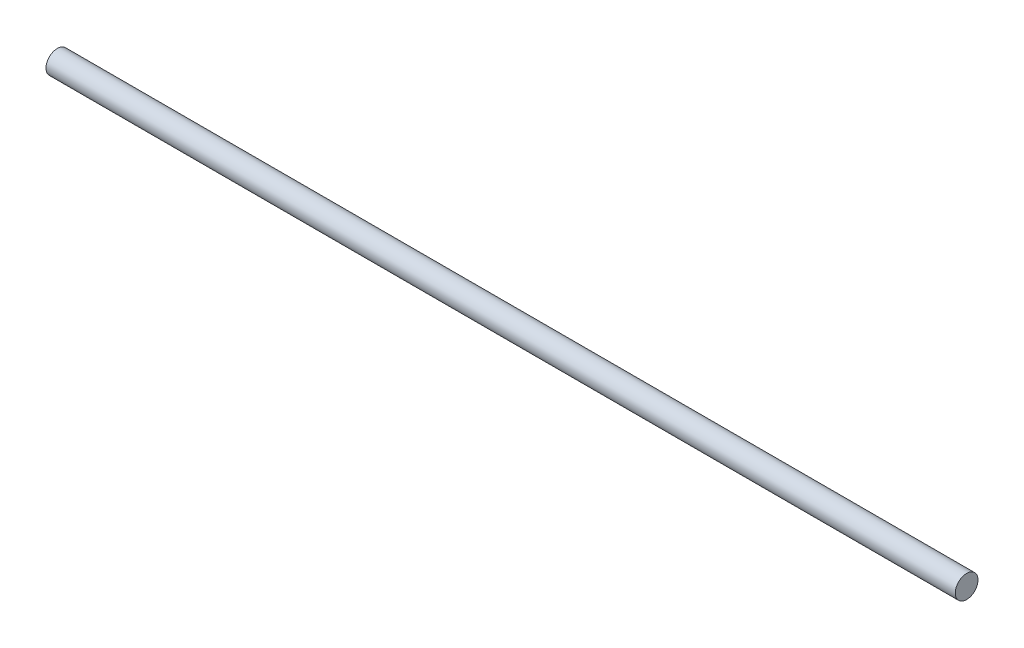
ISO-10303-21;
HEADER;
FILE_DESCRIPTION(('STEP AP214'),'2;1');
FILE_NAME('part.step','',(''),(''),'','','');
FILE_SCHEMA(('AUTOMOTIVE_DESIGN { 1 0 10303 214 1 1 1 1 }'));
ENDSEC;
DATA;
#1=APPLICATION_CONTEXT('core data for automotive mechanical design processes');
#2=APPLICATION_PROTOCOL_DEFINITION('international standard','automotive_design',2000,#1);
#3=PRODUCT_CONTEXT('',#1,'mechanical');
#4=PRODUCT('Part','Part','',(#3));
#5=PRODUCT_RELATED_PRODUCT_CATEGORY('part','',(#4));
#6=PRODUCT_DEFINITION_FORMATION('','',#4);
#7=PRODUCT_DEFINITION_CONTEXT('part definition',#1,'design');
#8=PRODUCT_DEFINITION('design','',#6,#7);
#9=PRODUCT_DEFINITION_SHAPE('','',#8);
#10=(LENGTH_UNIT() NAMED_UNIT(*) SI_UNIT(.MILLI.,.METRE.));
#11=(NAMED_UNIT(*) PLANE_ANGLE_UNIT() SI_UNIT($,.RADIAN.));
#12=(NAMED_UNIT(*) SI_UNIT($,.STERADIAN.) SOLID_ANGLE_UNIT());
#13=UNCERTAINTY_MEASURE_WITH_UNIT(LENGTH_MEASURE(1.E-05),#10,'distance_accuracy_value','');
#14=(GEOMETRIC_REPRESENTATION_CONTEXT(3) GLOBAL_UNCERTAINTY_ASSIGNED_CONTEXT((#13)) GLOBAL_UNIT_ASSIGNED_CONTEXT((#10,
#11,#12)) REPRESENTATION_CONTEXT('',''));
#15=CARTESIAN_POINT('',(0.,0.,0.));
#16=DIRECTION('',(0.,0.,1.));
#17=DIRECTION('',(1.,0.,0.));
#18=AXIS2_PLACEMENT_3D('',#15,#16,#17);
#19=CARTESIAN_POINT('',(-45.9797089855556,3.97905939365728,0.));
#20=DIRECTION('',(-1.,0.,0.));
#21=DIRECTION('',(0.,-1.,0.));
#22=AXIS2_PLACEMENT_3D('',#19,#20,#21);
#23=PLANE('',#22);
#24=CARTESIAN_POINT('',(-45.9797089855556,3.97905939365728,0.));
#25=DIRECTION('',(1.,0.,0.));
#26=DIRECTION('',(0.,1.,0.));
#27=AXIS2_PLACEMENT_3D('',#24,#25,#26);
#28=CIRCLE('',#27,1.5);
#29=CARTESIAN_POINT('',(-45.9797089855556,5.47905939365728,0.));
#30=VERTEX_POINT('',#29);
#31=EDGE_CURVE('E10',#30,#30,#28,.T.);
#32=ORIENTED_EDGE('',*,*,#31,.F.);
#33=EDGE_LOOP('',(#32));
#34=FACE_BOUND('',#33,.T.);
#35=ADVANCED_FACE('F31',(#34),#23,.T.);
#36=CARTESIAN_POINT('',(74.0202910144444,3.97905939365729,0.));
#37=DIRECTION('',(1.,0.,0.));
#38=DIRECTION('',(0.,1.,0.));
#39=AXIS2_PLACEMENT_3D('',#36,#37,#38);
#40=CYLINDRICAL_SURFACE('',#39,1.49999999999999);
#41=ORIENTED_EDGE('',*,*,#31,.T.);
#42=EDGE_LOOP('',(#41));
#43=FACE_BOUND('',#42,.T.);
#44=CARTESIAN_POINT('',(74.0202910144444,3.97905939365729,0.));
#45=DIRECTION('',(1.,0.,0.));
#46=DIRECTION('',(0.,1.,0.));
#47=AXIS2_PLACEMENT_3D('',#44,#45,#46);
#48=CIRCLE('',#47,1.49999999999999);
#49=CARTESIAN_POINT('',(74.0202910144444,5.47905939365728,0.));
#50=VERTEX_POINT('',#49);
#51=EDGE_CURVE('E37',#50,#50,#48,.T.);
#52=ORIENTED_EDGE('',*,*,#51,.F.);
#53=EDGE_LOOP('',(#52));
#54=FACE_BOUND('',#53,.T.);
#55=ADVANCED_FACE('F45',(#43,#54),#40,.T.);
#56=CARTESIAN_POINT('',(74.0202910144444,5.47905939365728,0.));
#57=DIRECTION('',(1.,0.,0.));
#58=DIRECTION('',(0.,1.,0.));
#59=AXIS2_PLACEMENT_3D('',#56,#57,#58);
#60=PLANE('',#59);
#61=ORIENTED_EDGE('',*,*,#51,.T.);
#62=EDGE_LOOP('',(#61));
#63=FACE_BOUND('',#62,.T.);
#64=ADVANCED_FACE('F43',(#63),#60,.T.);
#65=CLOSED_SHELL('',(#35,#55,#64));
#66=MANIFOLD_SOLID_BREP('B2',#65);
#67=ADVANCED_BREP_SHAPE_REPRESENTATION('',(#18,#66),#14);
#68=SHAPE_DEFINITION_REPRESENTATION(#9,#67);
ENDSEC;
END-ISO-10303-21;
